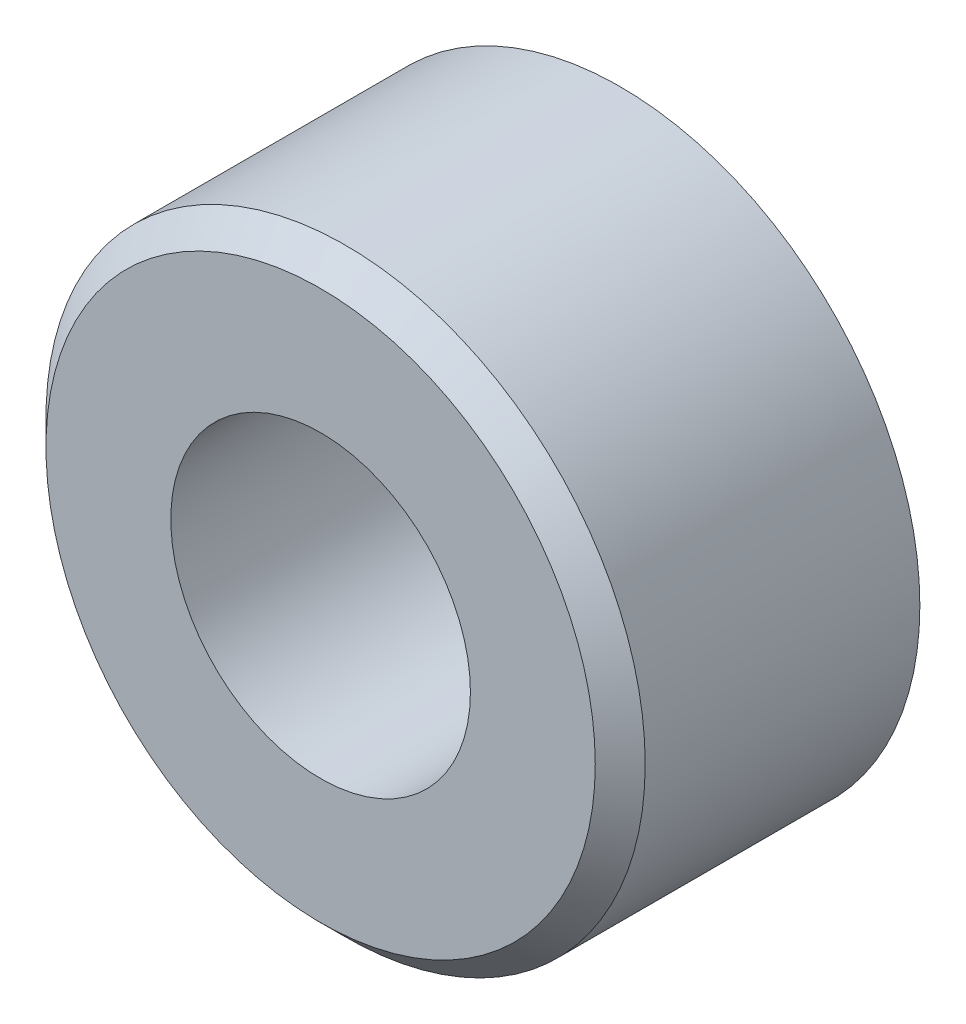
ISO-10303-21;
HEADER;
FILE_DESCRIPTION(('STEP AP214'),'2;1');
FILE_NAME('part.step','',(''),(''),'','','');
FILE_SCHEMA(('AUTOMOTIVE_DESIGN { 1 0 10303 214 1 1 1 1 }'));
ENDSEC;
DATA;
#1=APPLICATION_CONTEXT('core data for automotive mechanical design processes');
#2=APPLICATION_PROTOCOL_DEFINITION('international standard','automotive_design',2000,#1);
#3=PRODUCT_CONTEXT('',#1,'mechanical');
#4=PRODUCT('Part','Part','',(#3));
#5=PRODUCT_RELATED_PRODUCT_CATEGORY('part','',(#4));
#6=PRODUCT_DEFINITION_FORMATION('','',#4);
#7=PRODUCT_DEFINITION_CONTEXT('part definition',#1,'design');
#8=PRODUCT_DEFINITION('design','',#6,#7);
#9=PRODUCT_DEFINITION_SHAPE('','',#8);
#10=(LENGTH_UNIT() NAMED_UNIT(*) SI_UNIT(.MILLI.,.METRE.));
#11=(NAMED_UNIT(*) PLANE_ANGLE_UNIT() SI_UNIT($,.RADIAN.));
#12=(NAMED_UNIT(*) SI_UNIT($,.STERADIAN.) SOLID_ANGLE_UNIT());
#13=UNCERTAINTY_MEASURE_WITH_UNIT(LENGTH_MEASURE(1.E-05),#10,'distance_accuracy_value','');
#14=(GEOMETRIC_REPRESENTATION_CONTEXT(3) GLOBAL_UNCERTAINTY_ASSIGNED_CONTEXT((#13)) GLOBAL_UNIT_ASSIGNED_CONTEXT((#10,
#11,#12)) REPRESENTATION_CONTEXT('',''));
#15=CARTESIAN_POINT('',(0.,0.,0.));
#16=DIRECTION('',(0.,0.,1.));
#17=DIRECTION('',(1.,0.,0.));
#18=AXIS2_PLACEMENT_3D('',#15,#16,#17);
#19=CARTESIAN_POINT('',(0.,0.,6.));
#20=DIRECTION('',(0.,0.,1.));
#21=DIRECTION('',(1.,0.,0.));
#22=AXIS2_PLACEMENT_3D('',#19,#20,#21);
#23=PLANE('',#22);
#24=CARTESIAN_POINT('',(0.,0.,6.));
#25=DIRECTION('',(0.,0.,1.));
#26=DIRECTION('',(1.,0.,0.));
#27=AXIS2_PLACEMENT_3D('',#24,#25,#26);
#28=CIRCLE('',#27,5.5);
#29=CARTESIAN_POINT('',(5.5,0.,6.));
#30=VERTEX_POINT('',#29);
#31=EDGE_CURVE('E38',#30,#30,#28,.T.);
#32=ORIENTED_EDGE('',*,*,#31,.T.);
#33=EDGE_LOOP('',(#32));
#34=FACE_BOUND('',#33,.T.);
#35=CARTESIAN_POINT('',(0.,0.,6.));
#36=DIRECTION('',(0.,0.,1.));
#37=DIRECTION('',(1.,0.,0.));
#38=AXIS2_PLACEMENT_3D('',#35,#36,#37);
#39=CIRCLE('',#38,3.);
#40=CARTESIAN_POINT('',(3.,0.,6.));
#41=VERTEX_POINT('',#40);
#42=EDGE_CURVE('E46',#41,#41,#39,.T.);
#43=ORIENTED_EDGE('',*,*,#42,.F.);
#44=EDGE_LOOP('',(#43));
#45=FACE_BOUND('',#44,.T.);
#46=ADVANCED_FACE('F31',(#34,#45),#23,.T.);
#47=CARTESIAN_POINT('',(0.,0.,0.));
#48=DIRECTION('',(0.,0.,1.));
#49=DIRECTION('',(1.,0.,0.));
#50=AXIS2_PLACEMENT_3D('',#47,#48,#49);
#51=PLANE('',#50);
#52=CARTESIAN_POINT('',(0.,0.,0.));
#53=DIRECTION('',(0.,0.,1.));
#54=DIRECTION('',(1.,0.,0.));
#55=AXIS2_PLACEMENT_3D('',#52,#53,#54);
#56=CIRCLE('',#55,6.);
#57=CARTESIAN_POINT('',(6.,0.,0.));
#58=VERTEX_POINT('',#57);
#59=EDGE_CURVE('E42',#58,#58,#56,.T.);
#60=ORIENTED_EDGE('',*,*,#59,.F.);
#61=EDGE_LOOP('',(#60));
#62=FACE_BOUND('',#61,.T.);
#63=CARTESIAN_POINT('',(0.,0.,0.));
#64=DIRECTION('',(0.,0.,1.));
#65=DIRECTION('',(1.,0.,0.));
#66=AXIS2_PLACEMENT_3D('',#63,#64,#65);
#67=CIRCLE('',#66,3.);
#68=CARTESIAN_POINT('',(3.,0.,0.));
#69=VERTEX_POINT('',#68);
#70=EDGE_CURVE('E49',#69,#69,#67,.T.);
#71=ORIENTED_EDGE('',*,*,#70,.T.);
#72=EDGE_LOOP('',(#71));
#73=FACE_BOUND('',#72,.T.);
#74=ADVANCED_FACE('F59',(#62,#73),#51,.F.);
#75=CARTESIAN_POINT('',(0.,0.,6.));
#76=DIRECTION('',(0.,0.,-1.));
#77=DIRECTION('',(-1.,0.,0.));
#78=AXIS2_PLACEMENT_3D('',#75,#76,#77);
#79=CYLINDRICAL_SURFACE('',#78,6.);
#80=CARTESIAN_POINT('',(0.,0.,5.49999999999999));
#81=DIRECTION('',(0.,0.,1.));
#82=DIRECTION('',(1.,0.,0.));
#83=AXIS2_PLACEMENT_3D('',#80,#81,#82);
#84=CIRCLE('',#83,6.);
#85=CARTESIAN_POINT('',(6.,0.,5.49999999999999));
#86=VERTEX_POINT('',#85);
#87=EDGE_CURVE('E10',#86,#86,#84,.F.);
#88=ORIENTED_EDGE('',*,*,#87,.T.);
#89=EDGE_LOOP('',(#88));
#90=FACE_BOUND('',#89,.T.);
#91=ORIENTED_EDGE('',*,*,#59,.T.);
#92=EDGE_LOOP('',(#91));
#93=FACE_BOUND('',#92,.T.);
#94=ADVANCED_FACE('F66',(#90,#93),#79,.T.);
#95=CARTESIAN_POINT('',(0.,0.,6.));
#96=DIRECTION('',(0.,0.,-1.));
#97=DIRECTION('',(-1.,0.,0.));
#98=AXIS2_PLACEMENT_3D('',#95,#96,#97);
#99=CYLINDRICAL_SURFACE('',#98,3.);
#100=ORIENTED_EDGE('',*,*,#42,.T.);
#101=EDGE_LOOP('',(#100));
#102=FACE_BOUND('',#101,.T.);
#103=ORIENTED_EDGE('',*,*,#70,.F.);
#104=EDGE_LOOP('',(#103));
#105=FACE_BOUND('',#104,.T.);
#106=ADVANCED_FACE('F55',(#102,#105),#99,.F.);
#107=CARTESIAN_POINT('',(0.,0.,6.));
#108=DIRECTION('',(0.,0.,-1.));
#109=DIRECTION('',(-1.,0.,0.));
#110=AXIS2_PLACEMENT_3D('',#107,#108,#109);
#111=CONICAL_SURFACE('',#110,5.5,0.785398163397447);
#112=ORIENTED_EDGE('',*,*,#87,.F.);
#113=EDGE_LOOP('',(#112));
#114=FACE_BOUND('',#113,.T.);
#115=ORIENTED_EDGE('',*,*,#31,.F.);
#116=EDGE_LOOP('',(#115));
#117=FACE_BOUND('',#116,.T.);
#118=ADVANCED_FACE('F33',(#114,#117),#111,.T.);
#119=CLOSED_SHELL('',(#46,#74,#94,#106,#118));
#120=MANIFOLD_SOLID_BREP('B2',#119);
#121=ADVANCED_BREP_SHAPE_REPRESENTATION('',(#18,#120),#14);
#122=SHAPE_DEFINITION_REPRESENTATION(#9,#121);
ENDSEC;
END-ISO-10303-21;
